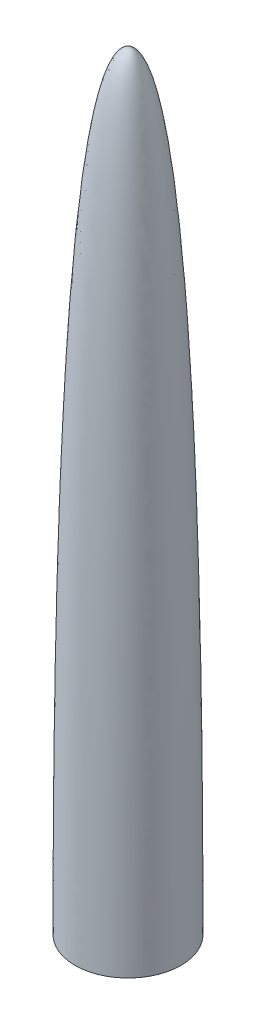
ISO-10303-21;
HEADER;
FILE_DESCRIPTION(('STEP AP214'),'2;1');
FILE_NAME('part.step','',(''),(''),'','','');
FILE_SCHEMA(('AUTOMOTIVE_DESIGN { 1 0 10303 214 1 1 1 1 }'));
ENDSEC;
DATA;
#1=APPLICATION_CONTEXT('core data for automotive mechanical design processes');
#2=APPLICATION_PROTOCOL_DEFINITION('international standard','automotive_design',2000,#1);
#3=PRODUCT_CONTEXT('',#1,'mechanical');
#4=PRODUCT('Part','Part','',(#3));
#5=PRODUCT_RELATED_PRODUCT_CATEGORY('part','',(#4));
#6=PRODUCT_DEFINITION_FORMATION('','',#4);
#7=PRODUCT_DEFINITION_CONTEXT('part definition',#1,'design');
#8=PRODUCT_DEFINITION('design','',#6,#7);
#9=PRODUCT_DEFINITION_SHAPE('','',#8);
#10=(LENGTH_UNIT() NAMED_UNIT(*) SI_UNIT(.MILLI.,.METRE.));
#11=(NAMED_UNIT(*) PLANE_ANGLE_UNIT() SI_UNIT($,.RADIAN.));
#12=(NAMED_UNIT(*) SI_UNIT($,.STERADIAN.) SOLID_ANGLE_UNIT());
#13=UNCERTAINTY_MEASURE_WITH_UNIT(LENGTH_MEASURE(1.E-05),#10,'distance_accuracy_value','');
#14=(GEOMETRIC_REPRESENTATION_CONTEXT(3) GLOBAL_UNCERTAINTY_ASSIGNED_CONTEXT((#13)) GLOBAL_UNIT_ASSIGNED_CONTEXT((#10,
#11,#12)) REPRESENTATION_CONTEXT('',''));
#15=CARTESIAN_POINT('',(0.,0.,0.));
#16=DIRECTION('',(0.,0.,1.));
#17=DIRECTION('',(1.,0.,0.));
#18=AXIS2_PLACEMENT_3D('',#15,#16,#17);
#19=CARTESIAN_POINT('',(2.00660000000114,409.654213515166,0.));
#20=CARTESIAN_POINT('',(2.14969871261431,409.509236806279,0.));
#21=CARTESIAN_POINT('',(2.41149321900291,409.221386570883,0.));
#22=CARTESIAN_POINT('',(2.98748288250747,408.493454053531,0.));
#23=CARTESIAN_POINT('',(3.72065251146918,407.373068114459,0.));
#24=CARTESIAN_POINT('',(4.61726472613451,405.681670707196,0.));
#25=CARTESIAN_POINT('',(5.8071769461251,402.992229451694,0.));
#26=CARTESIAN_POINT('',(7.26493384211622,398.847767211844,0.));
#27=CARTESIAN_POINT('',(8.9345088912693,392.716553912912,0.));
#28=CARTESIAN_POINT('',(10.5156048764625,385.503405123729,0.));
#29=CARTESIAN_POINT('',(12.5019651672304,374.534347283573,0.));
#30=CARTESIAN_POINT('',(14.7569429440448,358.449413562277,0.));
#31=CARTESIAN_POINT('',(17.112977897704,335.8364531559,0.));
#32=CARTESIAN_POINT('',(19.1403358636955,310.383994181056,0.));
#33=CARTESIAN_POINT('',(20.8617215642546,282.558603796906,0.));
#34=CARTESIAN_POINT('',(22.300580339305,252.824154762461,0.));
#35=CARTESIAN_POINT('',(23.4806222224621,221.643240653434,0.));
#36=CARTESIAN_POINT('',(24.4256981577328,189.477715275599,0.));
#37=CARTESIAN_POINT('',(25.1597265886445,156.789003641121,0.));
#38=CARTESIAN_POINT('',(25.7066637355631,124.038262208239,0.));
#39=CARTESIAN_POINT('',(26.0265163667278,97.0784345594254,0.));
#40=CARTESIAN_POINT('',(26.2128365010888,75.9404801633686,0.));
#41=CARTESIAN_POINT('',(26.3207952125984,60.3595526424521,0.));
#42=CARTESIAN_POINT('',(26.3999723505261,45.1088108390001,0.));
#43=CARTESIAN_POINT('',(26.4444688141687,32.7228380876016,0.));
#44=CARTESIAN_POINT('',(26.4686754175165,23.0370133107655,0.));
#45=CARTESIAN_POINT('',(26.4815103242268,15.8903659102131,0.));
#46=CARTESIAN_POINT('',(26.4880846895946,10.042159303772,0.));
#47=CARTESIAN_POINT('',(26.4910601952105,5.42430699354607,0.));
#48=CARTESIAN_POINT('',(26.4918156559848,3.14860433441638,0.));
#49=CARTESIAN_POINT('',(26.4920203881932,2.00660000000364,0.));
#50=B_SPLINE_CURVE_WITH_KNOTS('',3,(#19,#20,#21,#22,#23,#24,#25,#26,#27,#28,#29,#30,#31,#32,#33,
#34,#35,#36,#37,#38,#39,#40,#41,#42,#43,#44,#45,#46,#47,#48,#49),.UNSPECIFIED.,.F.,.F.,(4,1,1,1,
1,1,1,1,1,1,1,1,1,1,1,1,1,1,1,1,1,1,1,1,1,1,1,1,4),(0.0469870981450275,0.0543983225503647,
0.0618095469557019,0.0766319957663762,0.0914544445770506,0.106276893387725,0.135921791009074,
0.165566688630422,0.195211586251771,0.22485648387312,0.284146279115817,0.343436074358514,
0.402725869601212,0.462015664843909,0.521305460086607,0.580595255329304,0.639885050572001,
0.699174845814699,0.758464641057396,0.817754436300093,0.847399333921442,0.877044231542791,
0.90668912916414,0.936334026785488,0.951156475596163,0.965978924406837,0.980801373217511,
0.988212597622849,0.995623822028186),.UNSPECIFIED.);
#51=CARTESIAN_POINT('',(0.,433.3875,0.));
#52=DIRECTION('',(0.,1.,0.));
#53=AXIS1_PLACEMENT('',#51,#52);
#54=SURFACE_OF_REVOLUTION('',#50,#53);
#55=CARTESIAN_POINT('',(0.,2.00660000000363,0.));
#56=DIRECTION('',(0.,1.,0.));
#57=DIRECTION('',(0.,0.,1.));
#58=AXIS2_PLACEMENT_3D('',#55,#56,#57);
#59=CIRCLE('',#58,26.4920203881932);
#60=CARTESIAN_POINT('',(0.,2.00660000000363,26.4920203881932));
#61=VERTEX_POINT('',#60);
#62=EDGE_CURVE('E11',#61,#61,#59,.T.);
#63=ORIENTED_EDGE('',*,*,#62,.F.);
#64=EDGE_LOOP('',(#63));
#65=FACE_BOUND('',#64,.T.);
#66=CARTESIAN_POINT('',(0.,409.654213515166,0.));
#67=DIRECTION('',(0.,1.,0.));
#68=DIRECTION('',(0.,0.,1.));
#69=AXIS2_PLACEMENT_3D('',#66,#67,#68);
#70=CIRCLE('',#69,2.00660000000114);
#71=CARTESIAN_POINT('',(0.,409.654213515166,2.00660000000114));
#72=VERTEX_POINT('',#71);
#73=EDGE_CURVE('E64',#72,#72,#70,.T.);
#74=ORIENTED_EDGE('',*,*,#73,.T.);
#75=EDGE_LOOP('',(#74));
#76=FACE_BOUND('',#75,.T.);
#77=ADVANCED_FACE('F42',(#65,#76),#54,.T.);
#78=CARTESIAN_POINT('',(0.,433.3875,0.));
#79=DIRECTION('',(0.,1.,0.));
#80=DIRECTION('',(0.,0.,1.));
#81=AXIS2_PLACEMENT_3D('',#78,#79,#80);
#82=CYLINDRICAL_SURFACE('',#81,26.4920203881932);
#83=CARTESIAN_POINT('',(0.,0.,0.));
#84=DIRECTION('',(0.,1.,0.));
#85=DIRECTION('',(0.,0.,1.));
#86=AXIS2_PLACEMENT_3D('',#83,#84,#85);
#87=CIRCLE('',#86,26.4920203881932);
#88=CARTESIAN_POINT('',(0.,0.,26.4920203881932));
#89=VERTEX_POINT('',#88);
#90=EDGE_CURVE('E50',#89,#89,#87,.T.);
#91=ORIENTED_EDGE('',*,*,#90,.F.);
#92=EDGE_LOOP('',(#91));
#93=FACE_BOUND('',#92,.T.);
#94=ORIENTED_EDGE('',*,*,#62,.T.);
#95=EDGE_LOOP('',(#94));
#96=FACE_BOUND('',#95,.T.);
#97=ADVANCED_FACE('F84',(#93,#96),#82,.F.);
#98=CARTESIAN_POINT('',(26.4920203881932,0.,0.));
#99=DIRECTION('',(0.,1.,0.));
#100=DIRECTION('',(0.,0.,1.));
#101=AXIS2_PLACEMENT_3D('',#98,#99,#100);
#102=PLANE('',#101);
#103=CARTESIAN_POINT('',(0.,0.,0.));
#104=DIRECTION('',(0.,1.,0.));
#105=DIRECTION('',(0.,0.,1.));
#106=AXIS2_PLACEMENT_3D('',#103,#104,#105);
#107=CIRCLE('',#106,28.4988);
#108=CARTESIAN_POINT('',(0.,0.,28.4988));
#109=VERTEX_POINT('',#108);
#110=EDGE_CURVE('E61',#109,#109,#107,.T.);
#111=ORIENTED_EDGE('',*,*,#110,.F.);
#112=EDGE_LOOP('',(#111));
#113=FACE_BOUND('',#112,.T.);
#114=ORIENTED_EDGE('',*,*,#90,.T.);
#115=EDGE_LOOP('',(#114));
#116=FACE_BOUND('',#115,.T.);
#117=ADVANCED_FACE('F57',(#113,#116),#102,.F.);
#118=CARTESIAN_POINT('',(28.4988,0.,0.));
#119=CARTESIAN_POINT('',(28.4988,152.4,0.));
#120=CARTESIAN_POINT('',(25.4,412.75,0.));
#121=CARTESIAN_POINT('',(0.,412.75,0.));
#122=B_SPLINE_CURVE_WITH_KNOTS('',3,(#118,#119,#120,#121),.UNSPECIFIED.,.F.,.F.,(4,4),(0.,1.),.UNSPECIFIED.);
#123=CARTESIAN_POINT('',(0.,433.3875,0.));
#124=DIRECTION('',(0.,1.,0.));
#125=AXIS1_PLACEMENT('',#123,#124);
#126=SURFACE_OF_REVOLUTION('',#122,#125);
#127=CARTESIAN_POINT('',(0.,412.75,0.));
#128=VERTEX_POINT('',#127);
#129=VERTEX_LOOP('',#128);
#130=FACE_BOUND('',#129,.T.);
#131=ORIENTED_EDGE('',*,*,#110,.T.);
#132=EDGE_LOOP('',(#131));
#133=FACE_BOUND('',#132,.T.);
#134=ADVANCED_FACE('F53',(#130,#133),#126,.T.);
#135=CARTESIAN_POINT('',(2.00660000000114,409.654213515166,0.));
#136=DIRECTION('',(0.,1.,0.));
#137=DIRECTION('',(0.,0.,1.));
#138=AXIS2_PLACEMENT_3D('',#135,#136,#137);
#139=PLANE('',#138);
#140=ORIENTED_EDGE('',*,*,#73,.F.);
#141=EDGE_LOOP('',(#140));
#142=FACE_BOUND('',#141,.T.);
#143=ADVANCED_FACE('F56',(#142),#139,.F.);
#144=CLOSED_SHELL('',(#77,#97,#117,#134,#143));
#145=MANIFOLD_SOLID_BREP('B2',#144);
#146=ADVANCED_BREP_SHAPE_REPRESENTATION('',(#18,#145),#14);
#147=SHAPE_DEFINITION_REPRESENTATION(#9,#146);
ENDSEC;
END-ISO-10303-21;
